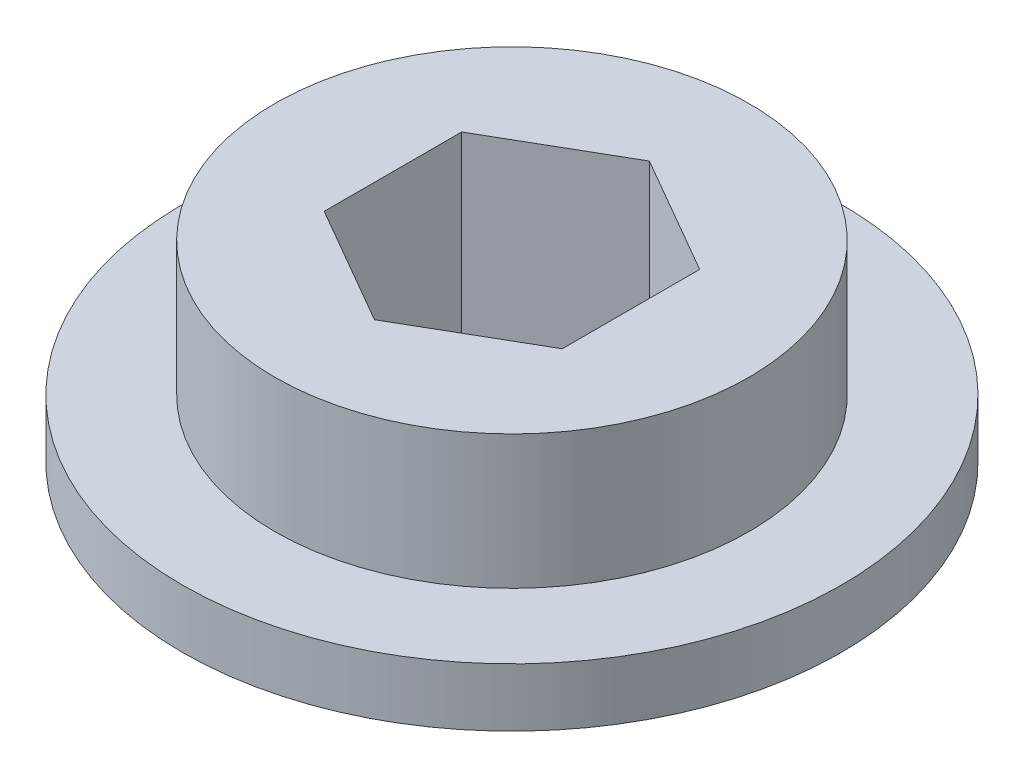
ISO-10303-21;
HEADER;
FILE_DESCRIPTION(('STEP AP214'),'2;1');
FILE_NAME('part.step','',(''),(''),'','','');
FILE_SCHEMA(('AUTOMOTIVE_DESIGN { 1 0 10303 214 1 1 1 1 }'));
ENDSEC;
DATA;
#1=APPLICATION_CONTEXT('core data for automotive mechanical design processes');
#2=APPLICATION_PROTOCOL_DEFINITION('international standard','automotive_design',2000,#1);
#3=PRODUCT_CONTEXT('',#1,'mechanical');
#4=PRODUCT('Part','Part','',(#3));
#5=PRODUCT_RELATED_PRODUCT_CATEGORY('part','',(#4));
#6=PRODUCT_DEFINITION_FORMATION('','',#4);
#7=PRODUCT_DEFINITION_CONTEXT('part definition',#1,'design');
#8=PRODUCT_DEFINITION('design','',#6,#7);
#9=PRODUCT_DEFINITION_SHAPE('','',#8);
#10=(LENGTH_UNIT() NAMED_UNIT(*) SI_UNIT(.MILLI.,.METRE.));
#11=(NAMED_UNIT(*) PLANE_ANGLE_UNIT() SI_UNIT($,.RADIAN.));
#12=(NAMED_UNIT(*) SI_UNIT($,.STERADIAN.) SOLID_ANGLE_UNIT());
#13=UNCERTAINTY_MEASURE_WITH_UNIT(LENGTH_MEASURE(1.E-05),#10,'distance_accuracy_value','');
#14=(GEOMETRIC_REPRESENTATION_CONTEXT(3) GLOBAL_UNCERTAINTY_ASSIGNED_CONTEXT((#13)) GLOBAL_UNIT_ASSIGNED_CONTEXT((#10,
#11,#12)) REPRESENTATION_CONTEXT('',''));
#15=CARTESIAN_POINT('',(0.,0.,0.));
#16=DIRECTION('',(0.,0.,1.));
#17=DIRECTION('',(1.,0.,0.));
#18=AXIS2_PLACEMENT_3D('',#15,#16,#17);
#19=CARTESIAN_POINT('',(0.,10.287,0.));
#20=DIRECTION('',(0.,1.,0.));
#21=DIRECTION('',(0.,0.,1.));
#22=AXIS2_PLACEMENT_3D('',#19,#20,#21);
#23=PLANE('',#22);
#24=DIRECTION('',(0.866025403784439,0.,-0.5));
#25=VECTOR('',#24,1.);
#26=CARTESIAN_POINT('',(0.,10.287,7.36167781238308));
#27=LINE('',#26,#25);
#28=CARTESIAN_POINT('',(0.,10.287,7.36167781238308));
#29=VERTEX_POINT('',#28);
#30=CARTESIAN_POINT('',(6.3754,10.287,3.68083890619154));
#31=VERTEX_POINT('',#30);
#32=EDGE_CURVE('E116',#29,#31,#27,.T.);
#33=ORIENTED_EDGE('',*,*,#32,.F.);
#34=DIRECTION('',(0.866025403784439,0.,0.5));
#35=VECTOR('',#34,1.);
#36=CARTESIAN_POINT('',(-6.3754,10.287,3.68083890619154));
#37=LINE('',#36,#35);
#38=CARTESIAN_POINT('',(-6.3754,10.287,3.68083890619154));
#39=VERTEX_POINT('',#38);
#40=EDGE_CURVE('E109',#39,#29,#37,.T.);
#41=ORIENTED_EDGE('',*,*,#40,.F.);
#42=DIRECTION('',(0.,0.,1.));
#43=VECTOR('',#42,1.);
#44=CARTESIAN_POINT('',(-6.3754,10.287,-3.68083890619154));
#45=LINE('',#44,#43);
#46=CARTESIAN_POINT('',(-6.3754,10.287,-3.68083890619154));
#47=VERTEX_POINT('',#46);
#48=EDGE_CURVE('E138',#47,#39,#45,.T.);
#49=ORIENTED_EDGE('',*,*,#48,.F.);
#50=DIRECTION('',(-0.866025403784439,0.,0.5));
#51=VECTOR('',#50,1.);
#52=CARTESIAN_POINT('',(0.,10.287,-7.36167781238308));
#53=LINE('',#52,#51);
#54=CARTESIAN_POINT('',(0.,10.287,-7.36167781238308));
#55=VERTEX_POINT('',#54);
#56=EDGE_CURVE('E136',#55,#47,#53,.T.);
#57=ORIENTED_EDGE('',*,*,#56,.F.);
#58=DIRECTION('',(-0.866025403784439,0.,-0.5));
#59=VECTOR('',#58,1.);
#60=CARTESIAN_POINT('',(6.3754,10.287,-3.68083890619154));
#61=LINE('',#60,#59);
#62=CARTESIAN_POINT('',(6.3754,10.287,-3.68083890619154));
#63=VERTEX_POINT('',#62);
#64=EDGE_CURVE('E131',#63,#55,#61,.T.);
#65=ORIENTED_EDGE('',*,*,#64,.F.);
#66=DIRECTION('',(0.,0.,-1.));
#67=VECTOR('',#66,1.);
#68=CARTESIAN_POINT('',(6.3754,10.287,3.68083890619154));
#69=LINE('',#68,#67);
#70=EDGE_CURVE('E129',#31,#63,#69,.T.);
#71=ORIENTED_EDGE('',*,*,#70,.F.);
#72=EDGE_LOOP('',(#33,#41,#49,#57,#65,#71));
#73=FACE_BOUND('',#72,.T.);
#74=CARTESIAN_POINT('',(0.,10.287,0.));
#75=DIRECTION('',(0.,1.,0.));
#76=DIRECTION('',(0.,0.,1.));
#77=AXIS2_PLACEMENT_3D('',#74,#75,#76);
#78=CIRCLE('',#77,12.7);
#79=CARTESIAN_POINT('',(0.,10.287,12.7));
#80=VERTEX_POINT('',#79);
#81=EDGE_CURVE('E202',#80,#80,#78,.T.);
#82=ORIENTED_EDGE('',*,*,#81,.T.);
#83=EDGE_LOOP('',(#82));
#84=FACE_BOUND('',#83,.T.);
#85=ADVANCED_FACE('F55',(#73,#84),#23,.T.);
#86=CARTESIAN_POINT('',(0.,10.287,0.));
#87=DIRECTION('',(0.,-1.,0.));
#88=DIRECTION('',(0.,0.,-1.));
#89=AXIS2_PLACEMENT_3D('',#86,#87,#88);
#90=CYLINDRICAL_SURFACE('',#89,17.653);
#91=CARTESIAN_POINT('',(0.,0.,0.));
#92=DIRECTION('',(0.,1.,0.));
#93=DIRECTION('',(0.,0.,1.));
#94=AXIS2_PLACEMENT_3D('',#91,#92,#93);
#95=CIRCLE('',#94,17.653);
#96=CARTESIAN_POINT('',(0.,0.,17.653));
#97=VERTEX_POINT('',#96);
#98=EDGE_CURVE('E12',#97,#97,#95,.T.);
#99=ORIENTED_EDGE('',*,*,#98,.T.);
#100=EDGE_LOOP('',(#99));
#101=FACE_BOUND('',#100,.T.);
#102=CARTESIAN_POINT('',(0.,3.1242,0.));
#103=DIRECTION('',(0.,1.,0.));
#104=DIRECTION('',(0.,0.,1.));
#105=AXIS2_PLACEMENT_3D('',#102,#103,#104);
#106=CIRCLE('',#105,17.653);
#107=CARTESIAN_POINT('',(0.,3.1242,17.653));
#108=VERTEX_POINT('',#107);
#109=EDGE_CURVE('E59',#108,#108,#106,.T.);
#110=ORIENTED_EDGE('',*,*,#109,.F.);
#111=EDGE_LOOP('',(#110));
#112=FACE_BOUND('',#111,.T.);
#113=ADVANCED_FACE('F57',(#101,#112),#90,.T.);
#114=CARTESIAN_POINT('',(0.,0.,0.));
#115=DIRECTION('',(0.,1.,0.));
#116=DIRECTION('',(0.,0.,1.));
#117=AXIS2_PLACEMENT_3D('',#114,#115,#116);
#118=PLANE('',#117);
#119=ORIENTED_EDGE('',*,*,#98,.F.);
#120=EDGE_LOOP('',(#119));
#121=FACE_BOUND('',#120,.T.);
#122=DIRECTION('',(0.866025403784439,0.,0.5));
#123=VECTOR('',#122,1.);
#124=CARTESIAN_POINT('',(-6.3754,0.,3.68083890619154));
#125=LINE('',#124,#123);
#126=CARTESIAN_POINT('',(-6.3754,0.,3.68083890619154));
#127=VERTEX_POINT('',#126);
#128=CARTESIAN_POINT('',(0.,0.,7.36167781238308));
#129=VERTEX_POINT('',#128);
#130=EDGE_CURVE('E79',#127,#129,#125,.T.);
#131=ORIENTED_EDGE('',*,*,#130,.T.);
#132=DIRECTION('',(0.866025403784439,0.,-0.5));
#133=VECTOR('',#132,1.);
#134=CARTESIAN_POINT('',(0.,0.,7.36167781238308));
#135=LINE('',#134,#133);
#136=CARTESIAN_POINT('',(6.3754,0.,3.68083890619154));
#137=VERTEX_POINT('',#136);
#138=EDGE_CURVE('E123',#129,#137,#135,.T.);
#139=ORIENTED_EDGE('',*,*,#138,.T.);
#140=DIRECTION('',(0.,0.,-1.));
#141=VECTOR('',#140,1.);
#142=CARTESIAN_POINT('',(6.3754,0.,3.68083890619154));
#143=LINE('',#142,#141);
#144=CARTESIAN_POINT('',(6.3754,0.,-3.68083890619154));
#145=VERTEX_POINT('',#144);
#146=EDGE_CURVE('E142',#137,#145,#143,.T.);
#147=ORIENTED_EDGE('',*,*,#146,.T.);
#148=DIRECTION('',(-0.866025403784439,0.,-0.5));
#149=VECTOR('',#148,1.);
#150=CARTESIAN_POINT('',(6.3754,0.,-3.68083890619154));
#151=LINE('',#150,#149);
#152=CARTESIAN_POINT('',(0.,0.,-7.36167781238308));
#153=VERTEX_POINT('',#152);
#154=EDGE_CURVE('E145',#145,#153,#151,.T.);
#155=ORIENTED_EDGE('',*,*,#154,.T.);
#156=DIRECTION('',(-0.866025403784439,0.,0.5));
#157=VECTOR('',#156,1.);
#158=CARTESIAN_POINT('',(0.,0.,-7.36167781238308));
#159=LINE('',#158,#157);
#160=CARTESIAN_POINT('',(-6.3754,0.,-3.68083890619154));
#161=VERTEX_POINT('',#160);
#162=EDGE_CURVE('E148',#153,#161,#159,.T.);
#163=ORIENTED_EDGE('',*,*,#162,.T.);
#164=DIRECTION('',(0.,0.,1.));
#165=VECTOR('',#164,1.);
#166=CARTESIAN_POINT('',(-6.3754,0.,-3.68083890619154));
#167=LINE('',#166,#165);
#168=EDGE_CURVE('E117',#161,#127,#167,.T.);
#169=ORIENTED_EDGE('',*,*,#168,.T.);
#170=EDGE_LOOP('',(#131,#139,#147,#155,#163,#169));
#171=FACE_BOUND('',#170,.T.);
#172=ADVANCED_FACE('F165',(#121,#171),#118,.F.);
#173=CARTESIAN_POINT('',(-6.3754,10.287,3.68083890619154));
#174=DIRECTION('',(0.5,0.,-0.866025403784439));
#175=DIRECTION('',(-0.866025403784439,0.,-0.5));
#176=AXIS2_PLACEMENT_3D('',#173,#174,#175);
#177=PLANE('',#176);
#178=ORIENTED_EDGE('',*,*,#130,.F.);
#179=DIRECTION('',(0.,-1.,0.));
#180=VECTOR('',#179,1.);
#181=CARTESIAN_POINT('',(-6.3754,10.287,3.68083890619154));
#182=LINE('',#181,#180);
#183=EDGE_CURVE('E112',#39,#127,#182,.T.);
#184=ORIENTED_EDGE('',*,*,#183,.F.);
#185=ORIENTED_EDGE('',*,*,#40,.T.);
#186=DIRECTION('',(0.,-1.,0.));
#187=VECTOR('',#186,1.);
#188=CARTESIAN_POINT('',(0.,10.287,7.36167781238308));
#189=LINE('',#188,#187);
#190=EDGE_CURVE('E64',#29,#129,#189,.T.);
#191=ORIENTED_EDGE('',*,*,#190,.T.);
#192=EDGE_LOOP('',(#178,#184,#185,#191));
#193=FACE_BOUND('',#192,.T.);
#194=ADVANCED_FACE('F111',(#193),#177,.T.);
#195=CARTESIAN_POINT('',(0.,10.287,7.36167781238308));
#196=DIRECTION('',(-0.5,0.,-0.866025403784439));
#197=DIRECTION('',(-0.866025403784439,0.,0.5));
#198=AXIS2_PLACEMENT_3D('',#195,#196,#197);
#199=PLANE('',#198);
#200=ORIENTED_EDGE('',*,*,#138,.F.);
#201=ORIENTED_EDGE('',*,*,#190,.F.);
#202=ORIENTED_EDGE('',*,*,#32,.T.);
#203=DIRECTION('',(0.,-1.,0.));
#204=VECTOR('',#203,1.);
#205=CARTESIAN_POINT('',(6.3754,10.287,3.68083890619154));
#206=LINE('',#205,#204);
#207=EDGE_CURVE('E124',#31,#137,#206,.T.);
#208=ORIENTED_EDGE('',*,*,#207,.T.);
#209=EDGE_LOOP('',(#200,#201,#202,#208));
#210=FACE_BOUND('',#209,.T.);
#211=ADVANCED_FACE('F120',(#210),#199,.T.);
#212=CARTESIAN_POINT('',(6.3754,10.287,3.68083890619154));
#213=DIRECTION('',(-1.,0.,0.));
#214=DIRECTION('',(0.,0.,1.));
#215=AXIS2_PLACEMENT_3D('',#212,#213,#214);
#216=PLANE('',#215);
#217=ORIENTED_EDGE('',*,*,#146,.F.);
#218=ORIENTED_EDGE('',*,*,#207,.F.);
#219=ORIENTED_EDGE('',*,*,#70,.T.);
#220=DIRECTION('',(0.,-1.,0.));
#221=VECTOR('',#220,1.);
#222=CARTESIAN_POINT('',(6.3754,10.287,-3.68083890619154));
#223=LINE('',#222,#221);
#224=EDGE_CURVE('E157',#63,#145,#223,.T.);
#225=ORIENTED_EDGE('',*,*,#224,.T.);
#226=EDGE_LOOP('',(#217,#218,#219,#225));
#227=FACE_BOUND('',#226,.T.);
#228=ADVANCED_FACE('F161',(#227),#216,.T.);
#229=CARTESIAN_POINT('',(6.3754,10.287,-3.68083890619154));
#230=DIRECTION('',(-0.5,0.,0.866025403784439));
#231=DIRECTION('',(0.866025403784439,0.,0.5));
#232=AXIS2_PLACEMENT_3D('',#229,#230,#231);
#233=PLANE('',#232);
#234=ORIENTED_EDGE('',*,*,#154,.F.);
#235=ORIENTED_EDGE('',*,*,#224,.F.);
#236=ORIENTED_EDGE('',*,*,#64,.T.);
#237=DIRECTION('',(0.,-1.,0.));
#238=VECTOR('',#237,1.);
#239=CARTESIAN_POINT('',(0.,10.287,-7.36167781238308));
#240=LINE('',#239,#238);
#241=EDGE_CURVE('E155',#55,#153,#240,.T.);
#242=ORIENTED_EDGE('',*,*,#241,.T.);
#243=EDGE_LOOP('',(#234,#235,#236,#242));
#244=FACE_BOUND('',#243,.T.);
#245=ADVANCED_FACE('F173',(#244),#233,.T.);
#246=CARTESIAN_POINT('',(0.,10.287,-7.36167781238308));
#247=DIRECTION('',(0.5,0.,0.866025403784439));
#248=DIRECTION('',(0.866025403784439,0.,-0.5));
#249=AXIS2_PLACEMENT_3D('',#246,#247,#248);
#250=PLANE('',#249);
#251=ORIENTED_EDGE('',*,*,#162,.F.);
#252=ORIENTED_EDGE('',*,*,#241,.F.);
#253=ORIENTED_EDGE('',*,*,#56,.T.);
#254=DIRECTION('',(0.,-1.,0.));
#255=VECTOR('',#254,1.);
#256=CARTESIAN_POINT('',(-6.3754,10.287,-3.68083890619154));
#257=LINE('',#256,#255);
#258=EDGE_CURVE('E71',#47,#161,#257,.T.);
#259=ORIENTED_EDGE('',*,*,#258,.T.);
#260=EDGE_LOOP('',(#251,#252,#253,#259));
#261=FACE_BOUND('',#260,.T.);
#262=ADVANCED_FACE('F171',(#261),#250,.T.);
#263=CARTESIAN_POINT('',(-6.3754,10.287,-3.68083890619154));
#264=DIRECTION('',(1.,0.,0.));
#265=DIRECTION('',(0.,0.,-1.));
#266=AXIS2_PLACEMENT_3D('',#263,#264,#265);
#267=PLANE('',#266);
#268=ORIENTED_EDGE('',*,*,#168,.F.);
#269=ORIENTED_EDGE('',*,*,#258,.F.);
#270=ORIENTED_EDGE('',*,*,#48,.T.);
#271=ORIENTED_EDGE('',*,*,#183,.T.);
#272=EDGE_LOOP('',(#268,#269,#270,#271));
#273=FACE_BOUND('',#272,.T.);
#274=ADVANCED_FACE('F167',(#273),#267,.T.);
#275=CARTESIAN_POINT('',(0.,3.1242,0.));
#276=DIRECTION('',(0.,1.,0.));
#277=DIRECTION('',(0.,0.,1.));
#278=AXIS2_PLACEMENT_3D('',#275,#276,#277);
#279=PLANE('',#278);
#280=CARTESIAN_POINT('',(0.,3.1242,0.));
#281=DIRECTION('',(0.,1.,0.));
#282=DIRECTION('',(0.,0.,1.));
#283=AXIS2_PLACEMENT_3D('',#280,#281,#282);
#284=CIRCLE('',#283,12.7);
#285=CARTESIAN_POINT('',(0.,3.1242,12.7));
#286=VERTEX_POINT('',#285);
#287=EDGE_CURVE('E200',#286,#286,#284,.T.);
#288=ORIENTED_EDGE('',*,*,#287,.F.);
#289=EDGE_LOOP('',(#288));
#290=FACE_BOUND('',#289,.T.);
#291=ORIENTED_EDGE('',*,*,#109,.T.);
#292=EDGE_LOOP('',(#291));
#293=FACE_BOUND('',#292,.T.);
#294=ADVANCED_FACE('F211',(#290,#293),#279,.T.);
#295=CARTESIAN_POINT('',(0.,3.1242,0.));
#296=DIRECTION('',(0.,1.,0.));
#297=DIRECTION('',(0.,0.,1.));
#298=AXIS2_PLACEMENT_3D('',#295,#296,#297);
#299=CYLINDRICAL_SURFACE('',#298,12.7);
#300=ORIENTED_EDGE('',*,*,#287,.T.);
#301=EDGE_LOOP('',(#300));
#302=FACE_BOUND('',#301,.T.);
#303=ORIENTED_EDGE('',*,*,#81,.F.);
#304=EDGE_LOOP('',(#303));
#305=FACE_BOUND('',#304,.T.);
#306=ADVANCED_FACE('F209',(#302,#305),#299,.T.);
#307=CLOSED_SHELL('',(#85,#113,#172,#194,#211,#228,#245,#262,#274,#294,#306));
#308=MANIFOLD_SOLID_BREP('B2',#307);
#309=ADVANCED_BREP_SHAPE_REPRESENTATION('',(#18,#308),#14);
#310=SHAPE_DEFINITION_REPRESENTATION(#9,#309);
ENDSEC;
END-ISO-10303-21;
